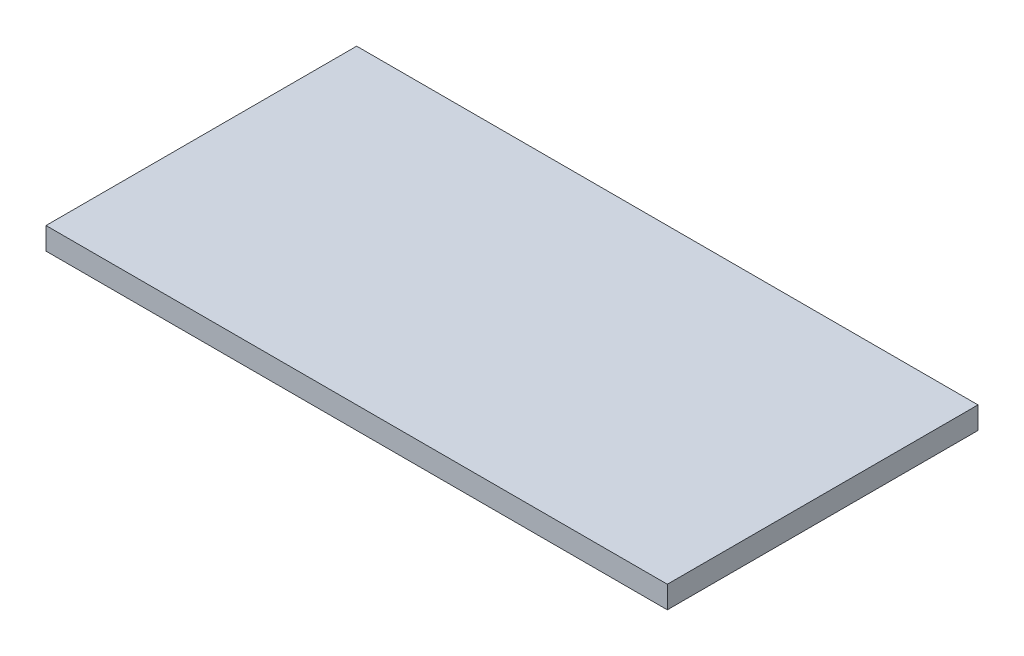
ISO-10303-21;
HEADER;
FILE_DESCRIPTION(('STEP AP214'),'2;1');
FILE_NAME('part.step','',(''),(''),'','','');
FILE_SCHEMA(('AUTOMOTIVE_DESIGN { 1 0 10303 214 1 1 1 1 }'));
ENDSEC;
DATA;
#1=APPLICATION_CONTEXT('core data for automotive mechanical design processes');
#2=APPLICATION_PROTOCOL_DEFINITION('international standard','automotive_design',2000,#1);
#3=PRODUCT_CONTEXT('',#1,'mechanical');
#4=PRODUCT('Part','Part','',(#3));
#5=PRODUCT_RELATED_PRODUCT_CATEGORY('part','',(#4));
#6=PRODUCT_DEFINITION_FORMATION('','',#4);
#7=PRODUCT_DEFINITION_CONTEXT('part definition',#1,'design');
#8=PRODUCT_DEFINITION('design','',#6,#7);
#9=PRODUCT_DEFINITION_SHAPE('','',#8);
#10=(LENGTH_UNIT() NAMED_UNIT(*) SI_UNIT(.MILLI.,.METRE.));
#11=(NAMED_UNIT(*) PLANE_ANGLE_UNIT() SI_UNIT($,.RADIAN.));
#12=(NAMED_UNIT(*) SI_UNIT($,.STERADIAN.) SOLID_ANGLE_UNIT());
#13=UNCERTAINTY_MEASURE_WITH_UNIT(LENGTH_MEASURE(1.E-05),#10,'distance_accuracy_value','');
#14=(GEOMETRIC_REPRESENTATION_CONTEXT(3) GLOBAL_UNCERTAINTY_ASSIGNED_CONTEXT((#13)) GLOBAL_UNIT_ASSIGNED_CONTEXT((#10,
#11,#12)) REPRESENTATION_CONTEXT('',''));
#15=CARTESIAN_POINT('',(0.,0.,0.));
#16=DIRECTION('',(0.,0.,1.));
#17=DIRECTION('',(1.,0.,0.));
#18=AXIS2_PLACEMENT_3D('',#15,#16,#17);
#19=CARTESIAN_POINT('',(0.,3.175,0.));
#20=DIRECTION('',(1.,0.,0.));
#21=DIRECTION('',(0.,0.,-1.));
#22=AXIS2_PLACEMENT_3D('',#19,#20,#21);
#23=PLANE('',#22);
#24=DIRECTION('',(0.,0.,1.));
#25=VECTOR('',#24,1.);
#26=CARTESIAN_POINT('',(0.,0.,0.));
#27=LINE('',#26,#25);
#28=CARTESIAN_POINT('',(0.,0.,0.));
#29=VERTEX_POINT('',#28);
#30=CARTESIAN_POINT('',(0.,0.,44.45));
#31=VERTEX_POINT('',#30);
#32=EDGE_CURVE('E96',#29,#31,#27,.T.);
#33=ORIENTED_EDGE('',*,*,#32,.T.);
#34=DIRECTION('',(0.,-1.,0.));
#35=VECTOR('',#34,1.);
#36=CARTESIAN_POINT('',(0.,3.175,44.45));
#37=LINE('',#36,#35);
#38=CARTESIAN_POINT('',(0.,3.175,44.45));
#39=VERTEX_POINT('',#38);
#40=EDGE_CURVE('E11',#39,#31,#37,.T.);
#41=ORIENTED_EDGE('',*,*,#40,.F.);
#42=DIRECTION('',(0.,0.,1.));
#43=VECTOR('',#42,1.);
#44=CARTESIAN_POINT('',(0.,3.175,0.));
#45=LINE('',#44,#43);
#46=CARTESIAN_POINT('',(0.,3.175,0.));
#47=VERTEX_POINT('',#46);
#48=EDGE_CURVE('E84',#47,#39,#45,.T.);
#49=ORIENTED_EDGE('',*,*,#48,.F.);
#50=DIRECTION('',(0.,-1.,0.));
#51=VECTOR('',#50,1.);
#52=CARTESIAN_POINT('',(0.,3.175,0.));
#53=LINE('',#52,#51);
#54=EDGE_CURVE('E92',#47,#29,#53,.T.);
#55=ORIENTED_EDGE('',*,*,#54,.T.);
#56=EDGE_LOOP('',(#33,#41,#49,#55));
#57=FACE_BOUND('',#56,.T.);
#58=ADVANCED_FACE('F33',(#57),#23,.F.);
#59=CARTESIAN_POINT('',(0.,3.175,44.45));
#60=DIRECTION('',(0.,0.,-1.));
#61=DIRECTION('',(-1.,0.,0.));
#62=AXIS2_PLACEMENT_3D('',#59,#60,#61);
#63=PLANE('',#62);
#64=DIRECTION('',(1.,0.,0.));
#65=VECTOR('',#64,1.);
#66=CARTESIAN_POINT('',(0.,0.,44.45));
#67=LINE('',#66,#65);
#68=CARTESIAN_POINT('',(88.9,0.,44.45));
#69=VERTEX_POINT('',#68);
#70=EDGE_CURVE('E88',#31,#69,#67,.T.);
#71=ORIENTED_EDGE('',*,*,#70,.T.);
#72=DIRECTION('',(0.,-1.,0.));
#73=VECTOR('',#72,1.);
#74=CARTESIAN_POINT('',(88.9,3.175,44.45));
#75=LINE('',#74,#73);
#76=CARTESIAN_POINT('',(88.9,3.175,44.45));
#77=VERTEX_POINT('',#76);
#78=EDGE_CURVE('E41',#77,#69,#75,.T.);
#79=ORIENTED_EDGE('',*,*,#78,.F.);
#80=DIRECTION('',(1.,0.,0.));
#81=VECTOR('',#80,1.);
#82=CARTESIAN_POINT('',(0.,3.175,44.45));
#83=LINE('',#82,#81);
#84=EDGE_CURVE('E79',#39,#77,#83,.T.);
#85=ORIENTED_EDGE('',*,*,#84,.F.);
#86=ORIENTED_EDGE('',*,*,#40,.T.);
#87=EDGE_LOOP('',(#71,#79,#85,#86));
#88=FACE_BOUND('',#87,.T.);
#89=ADVANCED_FACE('F87',(#88),#63,.F.);
#90=CARTESIAN_POINT('',(88.9,3.175,0.));
#91=DIRECTION('',(-1.,0.,0.));
#92=DIRECTION('',(0.,0.,1.));
#93=AXIS2_PLACEMENT_3D('',#90,#91,#92);
#94=PLANE('',#93);
#95=DIRECTION('',(0.,0.,-1.));
#96=VECTOR('',#95,1.);
#97=CARTESIAN_POINT('',(88.9,0.,0.));
#98=LINE('',#97,#96);
#99=CARTESIAN_POINT('',(88.9,0.,0.));
#100=VERTEX_POINT('',#99);
#101=EDGE_CURVE('E66',#69,#100,#98,.T.);
#102=ORIENTED_EDGE('',*,*,#101,.T.);
#103=DIRECTION('',(0.,-1.,0.));
#104=VECTOR('',#103,1.);
#105=CARTESIAN_POINT('',(88.9,3.175,0.));
#106=LINE('',#105,#104);
#107=CARTESIAN_POINT('',(88.9,3.175,0.));
#108=VERTEX_POINT('',#107);
#109=EDGE_CURVE('E89',#108,#100,#106,.T.);
#110=ORIENTED_EDGE('',*,*,#109,.F.);
#111=DIRECTION('',(0.,0.,-1.));
#112=VECTOR('',#111,1.);
#113=CARTESIAN_POINT('',(88.9,3.175,0.));
#114=LINE('',#113,#112);
#115=EDGE_CURVE('E82',#77,#108,#114,.T.);
#116=ORIENTED_EDGE('',*,*,#115,.F.);
#117=ORIENTED_EDGE('',*,*,#78,.T.);
#118=EDGE_LOOP('',(#102,#110,#116,#117));
#119=FACE_BOUND('',#118,.T.);
#120=ADVANCED_FACE('F90',(#119),#94,.F.);
#121=CARTESIAN_POINT('',(0.,3.175,0.));
#122=DIRECTION('',(0.,0.,1.));
#123=DIRECTION('',(1.,0.,0.));
#124=AXIS2_PLACEMENT_3D('',#121,#122,#123);
#125=PLANE('',#124);
#126=DIRECTION('',(-1.,0.,0.));
#127=VECTOR('',#126,1.);
#128=CARTESIAN_POINT('',(0.,0.,0.));
#129=LINE('',#128,#127);
#130=EDGE_CURVE('E72',#100,#29,#129,.T.);
#131=ORIENTED_EDGE('',*,*,#130,.T.);
#132=ORIENTED_EDGE('',*,*,#54,.F.);
#133=DIRECTION('',(-1.,0.,0.));
#134=VECTOR('',#133,1.);
#135=CARTESIAN_POINT('',(0.,3.175,0.));
#136=LINE('',#135,#134);
#137=EDGE_CURVE('E49',#108,#47,#136,.T.);
#138=ORIENTED_EDGE('',*,*,#137,.F.);
#139=ORIENTED_EDGE('',*,*,#109,.T.);
#140=EDGE_LOOP('',(#131,#132,#138,#139));
#141=FACE_BOUND('',#140,.T.);
#142=ADVANCED_FACE('F103',(#141),#125,.F.);
#143=CARTESIAN_POINT('',(0.,3.175,0.));
#144=DIRECTION('',(0.,1.,0.));
#145=DIRECTION('',(0.,0.,1.));
#146=AXIS2_PLACEMENT_3D('',#143,#144,#145);
#147=PLANE('',#146);
#148=ORIENTED_EDGE('',*,*,#48,.T.);
#149=ORIENTED_EDGE('',*,*,#84,.T.);
#150=ORIENTED_EDGE('',*,*,#115,.T.);
#151=ORIENTED_EDGE('',*,*,#137,.T.);
#152=EDGE_LOOP('',(#148,#149,#150,#151));
#153=FACE_BOUND('',#152,.T.);
#154=ADVANCED_FACE('F80',(#153),#147,.T.);
#155=CARTESIAN_POINT('',(0.,0.,0.));
#156=DIRECTION('',(0.,1.,0.));
#157=DIRECTION('',(0.,0.,1.));
#158=AXIS2_PLACEMENT_3D('',#155,#156,#157);
#159=PLANE('',#158);
#160=ORIENTED_EDGE('',*,*,#32,.F.);
#161=ORIENTED_EDGE('',*,*,#130,.F.);
#162=ORIENTED_EDGE('',*,*,#101,.F.);
#163=ORIENTED_EDGE('',*,*,#70,.F.);
#164=EDGE_LOOP('',(#160,#161,#162,#163));
#165=FACE_BOUND('',#164,.T.);
#166=ADVANCED_FACE('F106',(#165),#159,.F.);
#167=CLOSED_SHELL('',(#58,#89,#120,#142,#154,#166));
#168=MANIFOLD_SOLID_BREP('B2',#167);
#169=ADVANCED_BREP_SHAPE_REPRESENTATION('',(#18,#168),#14);
#170=SHAPE_DEFINITION_REPRESENTATION(#9,#169);
ENDSEC;
END-ISO-10303-21;
